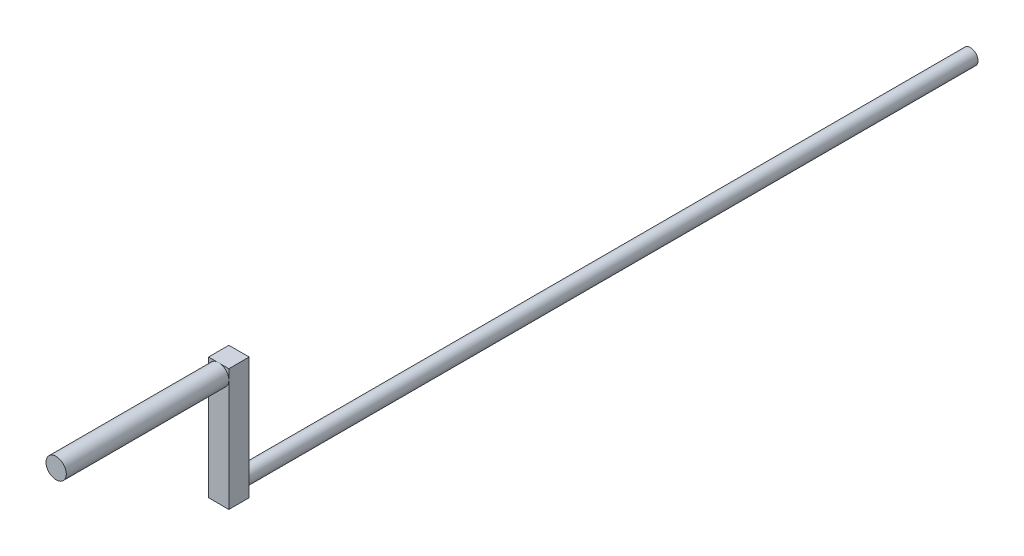
ISO-10303-21;
HEADER;
FILE_DESCRIPTION(('STEP AP214'),'2;1');
FILE_NAME('part.step','',(''),(''),'','','');
FILE_SCHEMA(('AUTOMOTIVE_DESIGN { 1 0 10303 214 1 1 1 1 }'));
ENDSEC;
DATA;
#1=APPLICATION_CONTEXT('core data for automotive mechanical design processes');
#2=APPLICATION_PROTOCOL_DEFINITION('international standard','automotive_design',2000,#1);
#3=PRODUCT_CONTEXT('',#1,'mechanical');
#4=PRODUCT('Part','Part','',(#3));
#5=PRODUCT_RELATED_PRODUCT_CATEGORY('part','',(#4));
#6=PRODUCT_DEFINITION_FORMATION('','',#4);
#7=PRODUCT_DEFINITION_CONTEXT('part definition',#1,'design');
#8=PRODUCT_DEFINITION('design','',#6,#7);
#9=PRODUCT_DEFINITION_SHAPE('','',#8);
#10=(LENGTH_UNIT() NAMED_UNIT(*) SI_UNIT(.MILLI.,.METRE.));
#11=(NAMED_UNIT(*) PLANE_ANGLE_UNIT() SI_UNIT($,.RADIAN.));
#12=(NAMED_UNIT(*) SI_UNIT($,.STERADIAN.) SOLID_ANGLE_UNIT());
#13=UNCERTAINTY_MEASURE_WITH_UNIT(LENGTH_MEASURE(1.E-05),#10,'distance_accuracy_value','');
#14=(GEOMETRIC_REPRESENTATION_CONTEXT(3) GLOBAL_UNCERTAINTY_ASSIGNED_CONTEXT((#13)) GLOBAL_UNIT_ASSIGNED_CONTEXT((#10,
#11,#12)) REPRESENTATION_CONTEXT('',''));
#15=CARTESIAN_POINT('',(0.,0.,0.));
#16=DIRECTION('',(0.,0.,1.));
#17=DIRECTION('',(1.,0.,0.));
#18=AXIS2_PLACEMENT_3D('',#15,#16,#17);
#19=CARTESIAN_POINT('',(0.,0.,234.95));
#20=DIRECTION('',(0.,0.,-1.));
#21=DIRECTION('',(-1.,0.,0.));
#22=AXIS2_PLACEMENT_3D('',#19,#20,#21);
#23=PLANE('',#22);
#24=CARTESIAN_POINT('',(0.0409641625246813,31.4420545649416,234.95));
#25=DIRECTION('',(0.,0.,1.));
#26=DIRECTION('',(1.,0.,0.));
#27=AXIS2_PLACEMENT_3D('',#24,#25,#26);
#28=CIRCLE('',#27,3.175);
#29=CARTESIAN_POINT('',(3.21596416252468,31.4420545649416,234.95));
#30=VERTEX_POINT('',#29);
#31=CARTESIAN_POINT('',(0.736675813849135,34.5398941828385,234.95));
#32=VERTEX_POINT('',#31);
#33=EDGE_CURVE('E109',#30,#32,#28,.T.);
#34=ORIENTED_EDGE('',*,*,#33,.F.);
#35=DIRECTION('',(0.,1.,0.));
#36=VECTOR('',#35,1.);
#37=CARTESIAN_POINT('',(3.21596416252468,-3.56010581716154,234.95));
#38=LINE('',#37,#36);
#39=CARTESIAN_POINT('',(3.21596416252468,34.5398941828384,234.95));
#40=VERTEX_POINT('',#39);
#41=EDGE_CURVE('E100',#30,#40,#38,.T.);
#42=ORIENTED_EDGE('',*,*,#41,.T.);
#43=DIRECTION('',(-1.,0.,0.));
#44=VECTOR('',#43,1.);
#45=CARTESIAN_POINT('',(-3.13403583747532,34.5398941828385,234.95));
#46=LINE('',#45,#44);
#47=EDGE_CURVE('E110',#40,#32,#46,.T.);
#48=ORIENTED_EDGE('',*,*,#47,.T.);
#49=EDGE_LOOP('',(#34,#42,#48));
#50=FACE_BOUND('',#49,.T.);
#51=ADVANCED_FACE('F34',(#50),#23,.F.);
#52=CARTESIAN_POINT('',(-0.654747488799759,34.5398941828385,234.95));
#53=VERTEX_POINT('',#52);
#54=CARTESIAN_POINT('',(-3.13403583747532,31.4420545649416,234.95));
#55=VERTEX_POINT('',#54);
#56=EDGE_CURVE('E11',#53,#55,#28,.T.);
#57=ORIENTED_EDGE('',*,*,#56,.F.);
#58=CARTESIAN_POINT('',(-3.13403583747532,34.5398941828385,234.95));
#59=VERTEX_POINT('',#58);
#60=EDGE_CURVE('E99',#53,#59,#46,.T.);
#61=ORIENTED_EDGE('',*,*,#60,.T.);
#62=DIRECTION('',(0.,-1.,0.));
#63=VECTOR('',#62,1.);
#64=CARTESIAN_POINT('',(-3.13403583747532,-3.56010581716154,234.95));
#65=LINE('',#64,#63);
#66=EDGE_CURVE('E120',#59,#55,#65,.T.);
#67=ORIENTED_EDGE('',*,*,#66,.T.);
#68=EDGE_LOOP('',(#57,#61,#67));
#69=FACE_BOUND('',#68,.T.);
#70=ADVANCED_FACE('F158',(#69),#23,.F.);
#71=CARTESIAN_POINT('',(0.,0.,228.6));
#72=DIRECTION('',(0.,0.,-1.));
#73=DIRECTION('',(-1.,0.,0.));
#74=AXIS2_PLACEMENT_3D('',#71,#72,#73);
#75=CYLINDRICAL_SURFACE('',#74,2.38125);
#76=CARTESIAN_POINT('',(0.,0.,228.6));
#77=DIRECTION('',(0.,0.,1.));
#78=DIRECTION('',(1.,0.,0.));
#79=AXIS2_PLACEMENT_3D('',#76,#77,#78);
#80=CIRCLE('',#79,2.38125);
#81=CARTESIAN_POINT('',(2.38125,0.,228.6));
#82=VERTEX_POINT('',#81);
#83=EDGE_CURVE('E116',#82,#82,#80,.T.);
#84=ORIENTED_EDGE('',*,*,#83,.F.);
#85=EDGE_LOOP('',(#84));
#86=FACE_BOUND('',#85,.T.);
#87=CARTESIAN_POINT('',(0.,0.,0.));
#88=DIRECTION('',(0.,0.,1.));
#89=DIRECTION('',(1.,0.,0.));
#90=AXIS2_PLACEMENT_3D('',#87,#88,#89);
#91=CIRCLE('',#90,2.38125);
#92=CARTESIAN_POINT('',(2.38125,0.,0.));
#93=VERTEX_POINT('',#92);
#94=EDGE_CURVE('E38',#93,#93,#91,.T.);
#95=ORIENTED_EDGE('',*,*,#94,.T.);
#96=EDGE_LOOP('',(#95));
#97=FACE_BOUND('',#96,.T.);
#98=ADVANCED_FACE('F36',(#86,#97),#75,.T.);
#99=CARTESIAN_POINT('',(0.,0.,0.));
#100=DIRECTION('',(0.,0.,1.));
#101=DIRECTION('',(1.,0.,0.));
#102=AXIS2_PLACEMENT_3D('',#99,#100,#101);
#103=PLANE('',#102);
#104=ORIENTED_EDGE('',*,*,#94,.F.);
#105=EDGE_LOOP('',(#104));
#106=FACE_BOUND('',#105,.T.);
#107=ADVANCED_FACE('F148',(#106),#103,.F.);
#108=CARTESIAN_POINT('',(-3.13403583747532,-3.56010581716154,234.95));
#109=DIRECTION('',(1.,0.,0.));
#110=DIRECTION('',(0.,0.,-1.));
#111=AXIS2_PLACEMENT_3D('',#108,#109,#110);
#112=PLANE('',#111);
#113=DIRECTION('',(0.,-1.,0.));
#114=VECTOR('',#113,1.);
#115=CARTESIAN_POINT('',(-3.13403583747532,-3.56010581716154,228.6));
#116=LINE('',#115,#114);
#117=CARTESIAN_POINT('',(-3.13403583747532,34.5398941828385,228.6));
#118=VERTEX_POINT('',#117);
#119=CARTESIAN_POINT('',(-3.13403583747532,-3.56010581716154,228.6));
#120=VERTEX_POINT('',#119);
#121=EDGE_CURVE('E126',#118,#120,#116,.T.);
#122=ORIENTED_EDGE('',*,*,#121,.T.);
#123=DIRECTION('',(0.,0.,-1.));
#124=VECTOR('',#123,1.);
#125=CARTESIAN_POINT('',(-3.13403583747532,-3.56010581716154,234.95));
#126=LINE('',#125,#124);
#127=CARTESIAN_POINT('',(-3.13403583747532,-3.56010581716154,234.95));
#128=VERTEX_POINT('',#127);
#129=EDGE_CURVE('E140',#128,#120,#126,.T.);
#130=ORIENTED_EDGE('',*,*,#129,.F.);
#131=EDGE_CURVE('E122',#55,#128,#65,.T.);
#132=ORIENTED_EDGE('',*,*,#131,.F.);
#133=ORIENTED_EDGE('',*,*,#66,.F.);
#134=DIRECTION('',(0.,0.,-1.));
#135=VECTOR('',#134,1.);
#136=CARTESIAN_POINT('',(-3.13403583747532,34.5398941828385,234.95));
#137=LINE('',#136,#135);
#138=EDGE_CURVE('E125',#59,#118,#137,.T.);
#139=ORIENTED_EDGE('',*,*,#138,.T.);
#140=EDGE_LOOP('',(#122,#130,#132,#133,#139));
#141=FACE_BOUND('',#140,.T.);
#142=ADVANCED_FACE('F150',(#141),#112,.F.);
#143=CARTESIAN_POINT('',(-3.13403583747532,-3.56010581716154,234.95));
#144=DIRECTION('',(0.,1.,0.));
#145=DIRECTION('',(0.,0.,1.));
#146=AXIS2_PLACEMENT_3D('',#143,#144,#145);
#147=PLANE('',#146);
#148=DIRECTION('',(1.,0.,0.));
#149=VECTOR('',#148,1.);
#150=CARTESIAN_POINT('',(-3.13403583747532,-3.56010581716154,228.6));
#151=LINE('',#150,#149);
#152=CARTESIAN_POINT('',(3.21596416252468,-3.56010581716154,228.6));
#153=VERTEX_POINT('',#152);
#154=EDGE_CURVE('E129',#120,#153,#151,.T.);
#155=ORIENTED_EDGE('',*,*,#154,.T.);
#156=DIRECTION('',(0.,0.,-1.));
#157=VECTOR('',#156,1.);
#158=CARTESIAN_POINT('',(3.21596416252468,-3.56010581716154,234.95));
#159=LINE('',#158,#157);
#160=CARTESIAN_POINT('',(3.21596416252468,-3.56010581716154,234.95));
#161=VERTEX_POINT('',#160);
#162=EDGE_CURVE('E138',#161,#153,#159,.T.);
#163=ORIENTED_EDGE('',*,*,#162,.F.);
#164=DIRECTION('',(1.,0.,0.));
#165=VECTOR('',#164,1.);
#166=CARTESIAN_POINT('',(-3.13403583747532,-3.56010581716154,234.95));
#167=LINE('',#166,#165);
#168=EDGE_CURVE('E95',#128,#161,#167,.T.);
#169=ORIENTED_EDGE('',*,*,#168,.F.);
#170=ORIENTED_EDGE('',*,*,#129,.T.);
#171=EDGE_LOOP('',(#155,#163,#169,#170));
#172=FACE_BOUND('',#171,.T.);
#173=ADVANCED_FACE('F155',(#172),#147,.F.);
#174=CARTESIAN_POINT('',(3.21596416252468,-3.56010581716154,234.95));
#175=DIRECTION('',(-1.,0.,0.));
#176=DIRECTION('',(0.,0.,1.));
#177=AXIS2_PLACEMENT_3D('',#174,#175,#176);
#178=PLANE('',#177);
#179=DIRECTION('',(0.,1.,0.));
#180=VECTOR('',#179,1.);
#181=CARTESIAN_POINT('',(3.21596416252468,-3.56010581716154,228.6));
#182=LINE('',#181,#180);
#183=CARTESIAN_POINT('',(3.21596416252468,34.5398941828384,228.6));
#184=VERTEX_POINT('',#183);
#185=EDGE_CURVE('E131',#153,#184,#182,.T.);
#186=ORIENTED_EDGE('',*,*,#185,.T.);
#187=DIRECTION('',(0.,0.,-1.));
#188=VECTOR('',#187,1.);
#189=CARTESIAN_POINT('',(3.21596416252468,34.5398941828384,234.95));
#190=LINE('',#189,#188);
#191=EDGE_CURVE('E106',#40,#184,#190,.T.);
#192=ORIENTED_EDGE('',*,*,#191,.F.);
#193=ORIENTED_EDGE('',*,*,#41,.F.);
#194=EDGE_CURVE('E89',#161,#30,#38,.T.);
#195=ORIENTED_EDGE('',*,*,#194,.F.);
#196=ORIENTED_EDGE('',*,*,#162,.T.);
#197=EDGE_LOOP('',(#186,#192,#193,#195,#196));
#198=FACE_BOUND('',#197,.T.);
#199=ADVANCED_FACE('F104',(#198),#178,.F.);
#200=CARTESIAN_POINT('',(-3.13403583747532,34.5398941828385,234.95));
#201=DIRECTION('',(0.,-1.,0.));
#202=DIRECTION('',(1.,0.,0.));
#203=AXIS2_PLACEMENT_3D('',#200,#201,#202);
#204=PLANE('',#203);
#205=DIRECTION('',(-1.,0.,0.));
#206=VECTOR('',#205,1.);
#207=CARTESIAN_POINT('',(-3.13403583747532,34.5398941828385,228.6));
#208=LINE('',#207,#206);
#209=EDGE_CURVE('E133',#184,#118,#208,.T.);
#210=ORIENTED_EDGE('',*,*,#209,.T.);
#211=ORIENTED_EDGE('',*,*,#138,.F.);
#212=ORIENTED_EDGE('',*,*,#60,.F.);
#213=EDGE_CURVE('E57',#32,#53,#46,.T.);
#214=ORIENTED_EDGE('',*,*,#213,.F.);
#215=ORIENTED_EDGE('',*,*,#47,.F.);
#216=ORIENTED_EDGE('',*,*,#191,.T.);
#217=EDGE_LOOP('',(#210,#211,#212,#214,#215,#216));
#218=FACE_BOUND('',#217,.T.);
#219=ADVANCED_FACE('F169',(#218),#204,.F.);
#220=EDGE_CURVE('E43',#55,#30,#28,.T.);
#221=ORIENTED_EDGE('',*,*,#220,.F.);
#222=ORIENTED_EDGE('',*,*,#131,.T.);
#223=ORIENTED_EDGE('',*,*,#168,.T.);
#224=ORIENTED_EDGE('',*,*,#194,.T.);
#225=EDGE_LOOP('',(#221,#222,#223,#224));
#226=FACE_BOUND('',#225,.T.);
#227=ADVANCED_FACE('F91',(#226),#23,.F.);
#228=CARTESIAN_POINT('',(0.,0.,228.6));
#229=DIRECTION('',(0.,0.,-1.));
#230=DIRECTION('',(-1.,0.,0.));
#231=AXIS2_PLACEMENT_3D('',#228,#229,#230);
#232=PLANE('',#231);
#233=ORIENTED_EDGE('',*,*,#83,.T.);
#234=EDGE_LOOP('',(#233));
#235=FACE_BOUND('',#234,.T.);
#236=ORIENTED_EDGE('',*,*,#121,.F.);
#237=ORIENTED_EDGE('',*,*,#209,.F.);
#238=ORIENTED_EDGE('',*,*,#185,.F.);
#239=ORIENTED_EDGE('',*,*,#154,.F.);
#240=EDGE_LOOP('',(#236,#237,#238,#239));
#241=FACE_BOUND('',#240,.T.);
#242=ADVANCED_FACE('F168',(#235,#241),#232,.T.);
#243=CARTESIAN_POINT('',(0.0409641625246813,31.4420545649416,234.95));
#244=DIRECTION('',(0.,0.,1.));
#245=DIRECTION('',(1.,0.,0.));
#246=AXIS2_PLACEMENT_3D('',#243,#244,#245);
#247=PLANE('',#246);
#248=EDGE_CURVE('E45',#32,#53,#28,.T.);
#249=ORIENTED_EDGE('',*,*,#248,.F.);
#250=ORIENTED_EDGE('',*,*,#213,.T.);
#251=EDGE_LOOP('',(#249,#250));
#252=FACE_BOUND('',#251,.T.);
#253=ADVANCED_FACE('F174',(#252),#247,.F.);
#254=CARTESIAN_POINT('',(0.0409641625246813,31.4420545649416,285.75));
#255=DIRECTION('',(0.,0.,-1.));
#256=DIRECTION('',(-1.,0.,0.));
#257=AXIS2_PLACEMENT_3D('',#254,#255,#256);
#258=CYLINDRICAL_SURFACE('',#257,3.175);
#259=CARTESIAN_POINT('',(0.0409641625246813,31.4420545649416,285.75));
#260=DIRECTION('',(0.,0.,1.));
#261=DIRECTION('',(1.,0.,0.));
#262=AXIS2_PLACEMENT_3D('',#259,#260,#261);
#263=CIRCLE('',#262,3.175);
#264=CARTESIAN_POINT('',(3.21596416252468,31.4420545649416,285.75));
#265=VERTEX_POINT('',#264);
#266=EDGE_CURVE('E114',#265,#265,#263,.T.);
#267=ORIENTED_EDGE('',*,*,#266,.F.);
#268=EDGE_LOOP('',(#267));
#269=FACE_BOUND('',#268,.T.);
#270=ORIENTED_EDGE('',*,*,#33,.T.);
#271=ORIENTED_EDGE('',*,*,#248,.T.);
#272=ORIENTED_EDGE('',*,*,#56,.T.);
#273=ORIENTED_EDGE('',*,*,#220,.T.);
#274=EDGE_LOOP('',(#270,#271,#272,#273));
#275=FACE_BOUND('',#274,.T.);
#276=ADVANCED_FACE('F115',(#269,#275),#258,.T.);
#277=CARTESIAN_POINT('',(0.0409641625246813,31.4420545649416,285.75));
#278=DIRECTION('',(0.,0.,1.));
#279=DIRECTION('',(1.,0.,0.));
#280=AXIS2_PLACEMENT_3D('',#277,#278,#279);
#281=PLANE('',#280);
#282=ORIENTED_EDGE('',*,*,#266,.T.);
#283=EDGE_LOOP('',(#282));
#284=FACE_BOUND('',#283,.T.);
#285=ADVANCED_FACE('F197',(#284),#281,.T.);
#286=CLOSED_SHELL('',(#51,#70,#98,#107,#142,#173,#199,#219,#227,#242,#253,#276,#285));
#287=MANIFOLD_SOLID_BREP('B2',#286);
#288=ADVANCED_BREP_SHAPE_REPRESENTATION('',(#18,#287),#14);
#289=SHAPE_DEFINITION_REPRESENTATION(#9,#288);
ENDSEC;
END-ISO-10303-21;
